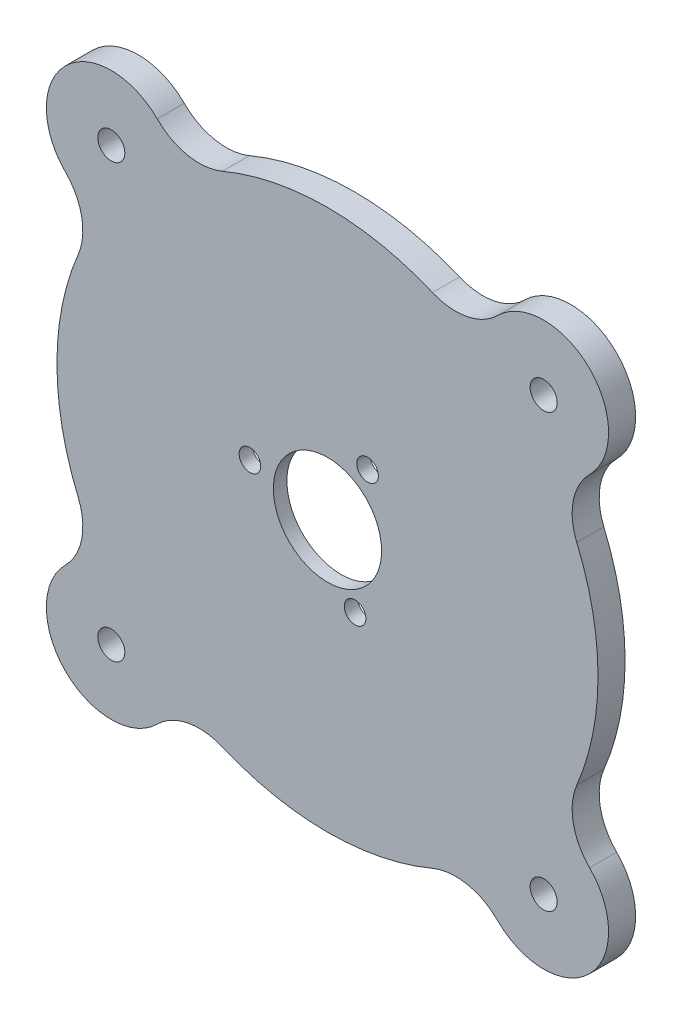
ISO-10303-21;
HEADER;
FILE_DESCRIPTION(('STEP AP214'),'2;1');
FILE_NAME('part.step','',(''),(''),'','','');
FILE_SCHEMA(('AUTOMOTIVE_DESIGN { 1 0 10303 214 1 1 1 1 }'));
ENDSEC;
DATA;
#1=APPLICATION_CONTEXT('core data for automotive mechanical design processes');
#2=APPLICATION_PROTOCOL_DEFINITION('international standard','automotive_design',2000,#1);
#3=PRODUCT_CONTEXT('',#1,'mechanical');
#4=PRODUCT('Part','Part','',(#3));
#5=PRODUCT_RELATED_PRODUCT_CATEGORY('part','',(#4));
#6=PRODUCT_DEFINITION_FORMATION('','',#4);
#7=PRODUCT_DEFINITION_CONTEXT('part definition',#1,'design');
#8=PRODUCT_DEFINITION('design','',#6,#7);
#9=PRODUCT_DEFINITION_SHAPE('','',#8);
#10=(LENGTH_UNIT() NAMED_UNIT(*) SI_UNIT(.MILLI.,.METRE.));
#11=(NAMED_UNIT(*) PLANE_ANGLE_UNIT() SI_UNIT($,.RADIAN.));
#12=(NAMED_UNIT(*) SI_UNIT($,.STERADIAN.) SOLID_ANGLE_UNIT());
#13=UNCERTAINTY_MEASURE_WITH_UNIT(LENGTH_MEASURE(1.E-05),#10,'distance_accuracy_value','');
#14=(GEOMETRIC_REPRESENTATION_CONTEXT(3) GLOBAL_UNCERTAINTY_ASSIGNED_CONTEXT((#13)) GLOBAL_UNIT_ASSIGNED_CONTEXT((#10,
#11,#12)) REPRESENTATION_CONTEXT('',''));
#15=CARTESIAN_POINT('',(0.,0.,0.));
#16=DIRECTION('',(0.,0.,1.));
#17=DIRECTION('',(1.,0.,0.));
#18=AXIS2_PLACEMENT_3D('',#15,#16,#17);
#19=CARTESIAN_POINT('',(-56.2173151134793,-23.6857511606009,10.));
#20=DIRECTION('',(0.,0.,1.));
#21=DIRECTION('',(1.,0.,0.));
#22=AXIS2_PLACEMENT_3D('',#19,#20,#21);
#23=PLANE('',#22);
#24=CARTESIAN_POINT('',(0.,0.,10.));
#25=DIRECTION('',(0.,0.,1.));
#26=DIRECTION('',(1.,0.,0.));
#27=AXIS2_PLACEMENT_3D('',#24,#25,#26);
#28=CIRCLE('',#27,20.);
#29=CARTESIAN_POINT('',(20.,0.,10.));
#30=VERTEX_POINT('',#29);
#31=EDGE_CURVE('E390',#30,#30,#28,.T.);
#32=ORIENTED_EDGE('',*,*,#31,.F.);
#33=EDGE_LOOP('',(#32));
#34=FACE_BOUND('',#33,.T.);
#35=CARTESIAN_POINT('',(-79.9030662740753,-79.9030677073512,10.));
#36=DIRECTION('',(0.,0.,1.));
#37=DIRECTION('',(1.,0.,0.));
#38=AXIS2_PLACEMENT_3D('',#35,#36,#37);
#39=CIRCLE('',#38,5.00000000000001);
#40=CARTESIAN_POINT('',(-74.9030662740753,-79.9030677073512,10.));
#41=VERTEX_POINT('',#40);
#42=EDGE_CURVE('E400',#41,#41,#39,.T.);
#43=ORIENTED_EDGE('',*,*,#42,.F.);
#44=EDGE_LOOP('',(#43));
#45=FACE_BOUND('',#44,.T.);
#46=CARTESIAN_POINT('',(79.9030662740794,79.9030662740804,10.));
#47=DIRECTION('',(0.,0.,1.));
#48=DIRECTION('',(1.,0.,0.));
#49=AXIS2_PLACEMENT_3D('',#46,#47,#48);
#50=CIRCLE('',#49,5.00000000000001);
#51=CARTESIAN_POINT('',(84.9030662740794,79.9030662740804,10.));
#52=VERTEX_POINT('',#51);
#53=EDGE_CURVE('E412',#52,#52,#50,.T.);
#54=ORIENTED_EDGE('',*,*,#53,.F.);
#55=EDGE_LOOP('',(#54));
#56=FACE_BOUND('',#55,.T.);
#57=CARTESIAN_POINT('',(10.2142663659799,-24.5395166705732,10.));
#58=DIRECTION('',(0.,0.,1.));
#59=DIRECTION('',(1.,0.,0.));
#60=AXIS2_PLACEMENT_3D('',#57,#58,#59);
#61=CIRCLE('',#60,4.);
#62=CARTESIAN_POINT('',(14.2142663659799,-24.5395166705732,10.));
#63=VERTEX_POINT('',#62);
#64=EDGE_CURVE('E420',#63,#63,#61,.T.);
#65=ORIENTED_EDGE('',*,*,#64,.F.);
#66=EDGE_LOOP('',(#65));
#67=FACE_BOUND('',#66,.T.);
#68=CARTESIAN_POINT('',(-112.434630226959,-47.371502321202,10.));
#69=DIRECTION('',(0.,0.,-1.));
#70=DIRECTION('',(1.,0.,0.));
#71=AXIS2_PLACEMENT_3D('',#68,#69,#70);
#72=CIRCLE('',#71,22.0065789473695);
#73=CARTESIAN_POINT('',(-92.154563464533,-38.8270064859674,10.));
#74=VERTEX_POINT('',#73);
#75=CARTESIAN_POINT('',(-96.8736290225562,-62.9325035256038,10.));
#76=VERTEX_POINT('',#75);
#77=EDGE_CURVE('E216',#74,#76,#72,.T.);
#78=ORIENTED_EDGE('',*,*,#77,.T.);
#79=CARTESIAN_POINT('',(-79.9030662740794,-79.9030662740803,10.));
#80=DIRECTION('',(0.,0.,1.));
#81=DIRECTION('',(1.,0.,0.));
#82=AXIS2_PLACEMENT_3D('',#79,#80,#81);
#83=CIRCLE('',#82,23.9999999999993);
#84=CARTESIAN_POINT('',(-62.932503525602,-96.8736290225561,10.));
#85=VERTEX_POINT('',#84);
#86=EDGE_CURVE('E124',#76,#85,#83,.T.);
#87=ORIENTED_EDGE('',*,*,#86,.T.);
#88=CARTESIAN_POINT('',(-47.3715023212008,-112.434630226959,10.));
#89=DIRECTION('',(0.,0.,-1.));
#90=DIRECTION('',(-1.,0.,0.));
#91=AXIS2_PLACEMENT_3D('',#88,#89,#90);
#92=CIRCLE('',#91,22.0065789473687);
#93=CARTESIAN_POINT('',(-38.8270064859666,-92.1545634645332,10.));
#94=VERTEX_POINT('',#93);
#95=EDGE_CURVE('E256',#85,#94,#92,.T.);
#96=ORIENTED_EDGE('',*,*,#95,.T.);
#97=CARTESIAN_POINT('',(0.,1.04083408558608E-13,10.));
#98=DIRECTION('',(0.,0.,1.));
#99=DIRECTION('',(1.,0.,0.));
#100=AXIS2_PLACEMENT_3D('',#97,#98,#99);
#101=CIRCLE('',#100,100.);
#102=CARTESIAN_POINT('',(38.8270064859666,-92.1545634645334,10.));
#103=VERTEX_POINT('',#102);
#104=EDGE_CURVE('E275',#94,#103,#101,.T.);
#105=ORIENTED_EDGE('',*,*,#104,.T.);
#106=CARTESIAN_POINT('',(47.3715023212008,-112.434630226959,10.));
#107=DIRECTION('',(0.,0.,-1.));
#108=DIRECTION('',(1.,0.,0.));
#109=AXIS2_PLACEMENT_3D('',#106,#107,#108);
#110=CIRCLE('',#109,22.0065789473694);
#111=CARTESIAN_POINT('',(62.9325035256023,-96.8736290225561,10.));
#112=VERTEX_POINT('',#111);
#113=EDGE_CURVE('E272',#103,#112,#110,.T.);
#114=ORIENTED_EDGE('',*,*,#113,.T.);
#115=CARTESIAN_POINT('',(79.9030662740795,-79.9030662740803,10.));
#116=DIRECTION('',(0.,0.,1.));
#117=DIRECTION('',(-1.,0.,0.));
#118=AXIS2_PLACEMENT_3D('',#115,#116,#117);
#119=CIRCLE('',#118,23.9999999999982);
#120=CARTESIAN_POINT('',(96.8736290225555,-62.9325035256045,10.));
#121=VERTEX_POINT('',#120);
#122=EDGE_CURVE('E274',#112,#121,#119,.T.);
#123=ORIENTED_EDGE('',*,*,#122,.T.);
#124=CARTESIAN_POINT('',(112.434630226959,-47.371502321202,10.));
#125=DIRECTION('',(0.,0.,-1.));
#126=DIRECTION('',(-1.,0.,0.));
#127=AXIS2_PLACEMENT_3D('',#124,#125,#126);
#128=CIRCLE('',#127,22.0065789473698);
#129=CARTESIAN_POINT('',(92.1545634645327,-38.827006485966,10.));
#130=VERTEX_POINT('',#129);
#131=EDGE_CURVE('E277',#121,#130,#128,.T.);
#132=ORIENTED_EDGE('',*,*,#131,.T.);
#133=CARTESIAN_POINT('',(0.,1.04083408558608E-13,10.));
#134=DIRECTION('',(0.,0.,1.));
#135=DIRECTION('',(1.,0.,0.));
#136=AXIS2_PLACEMENT_3D('',#133,#134,#135);
#137=CIRCLE('',#136,100.);
#138=CARTESIAN_POINT('',(92.154563464533,38.8270064859678,10.));
#139=VERTEX_POINT('',#138);
#140=EDGE_CURVE('E283',#130,#139,#137,.T.);
#141=ORIENTED_EDGE('',*,*,#140,.T.);
#142=CARTESIAN_POINT('',(112.434630226959,47.371502321202,10.));
#143=DIRECTION('',(0.,0.,-1.));
#144=DIRECTION('',(1.,0.,0.));
#145=AXIS2_PLACEMENT_3D('',#142,#143,#144);
#146=CIRCLE('',#145,22.0065789473689);
#147=CARTESIAN_POINT('',(96.8736290225568,62.9325035256034,10.));
#148=VERTEX_POINT('',#147);
#149=EDGE_CURVE('E285',#139,#148,#146,.T.);
#150=ORIENTED_EDGE('',*,*,#149,.T.);
#151=CARTESIAN_POINT('',(79.9030662740795,79.9030662740803,10.));
#152=DIRECTION('',(0.,0.,1.));
#153=DIRECTION('',(1.,0.,0.));
#154=AXIS2_PLACEMENT_3D('',#151,#152,#153);
#155=CIRCLE('',#154,24.);
#156=CARTESIAN_POINT('',(62.9325035256023,96.8736290225574,10.));
#157=VERTEX_POINT('',#156);
#158=EDGE_CURVE('E287',#148,#157,#155,.T.);
#159=ORIENTED_EDGE('',*,*,#158,.T.);
#160=CARTESIAN_POINT('',(47.3715023212009,112.434630226959,10.));
#161=DIRECTION('',(0.,0.,-1.));
#162=DIRECTION('',(-1.,0.,0.));
#163=AXIS2_PLACEMENT_3D('',#160,#161,#162);
#164=CIRCLE('',#163,22.0065789473684);
#165=CARTESIAN_POINT('',(38.8270064859668,92.1545634645333,10.));
#166=VERTEX_POINT('',#165);
#167=EDGE_CURVE('E289',#157,#166,#164,.T.);
#168=ORIENTED_EDGE('',*,*,#167,.T.);
#169=CARTESIAN_POINT('',(0.,1.04083408558608E-13,10.));
#170=DIRECTION('',(0.,0.,1.));
#171=DIRECTION('',(1.,0.,0.));
#172=AXIS2_PLACEMENT_3D('',#169,#170,#171);
#173=CIRCLE('',#172,99.9999999999999);
#174=CARTESIAN_POINT('',(-38.8270064859666,92.1545634645333,10.));
#175=VERTEX_POINT('',#174);
#176=EDGE_CURVE('E291',#166,#175,#173,.T.);
#177=ORIENTED_EDGE('',*,*,#176,.T.);
#178=CARTESIAN_POINT('',(-47.3715023212008,112.434630226959,10.));
#179=DIRECTION('',(0.,0.,-1.));
#180=DIRECTION('',(1.,0.,0.));
#181=AXIS2_PLACEMENT_3D('',#178,#179,#180);
#182=CIRCLE('',#181,22.0065789473688);
#183=CARTESIAN_POINT('',(-62.9325035256025,96.8736290225573,10.));
#184=VERTEX_POINT('',#183);
#185=EDGE_CURVE('E167',#175,#184,#182,.T.);
#186=ORIENTED_EDGE('',*,*,#185,.T.);
#187=CARTESIAN_POINT('',(-79.9030662740794,79.9030662740804,10.));
#188=DIRECTION('',(0.,0.,1.));
#189=DIRECTION('',(-1.,0.,0.));
#190=AXIS2_PLACEMENT_3D('',#187,#188,#189);
#191=CIRCLE('',#190,23.9999999999994);
#192=CARTESIAN_POINT('',(-96.8736290225569,62.9325035256045,10.));
#193=VERTEX_POINT('',#192);
#194=EDGE_CURVE('E161',#184,#193,#191,.T.);
#195=ORIENTED_EDGE('',*,*,#194,.T.);
#196=CARTESIAN_POINT('',(-112.434630226959,47.371502321202,10.));
#197=DIRECTION('',(0.,0.,-1.));
#198=DIRECTION('',(-1.,0.,0.));
#199=AXIS2_PLACEMENT_3D('',#196,#197,#198);
#200=CIRCLE('',#199,22.0065789473693);
#201=CARTESIAN_POINT('',(-92.1545634645327,38.8270064859674,10.));
#202=VERTEX_POINT('',#201);
#203=EDGE_CURVE('E165',#193,#202,#200,.T.);
#204=ORIENTED_EDGE('',*,*,#203,.T.);
#205=CARTESIAN_POINT('',(0.,1.04083408558608E-13,10.));
#206=DIRECTION('',(0.,0.,1.));
#207=DIRECTION('',(1.,0.,0.));
#208=AXIS2_PLACEMENT_3D('',#205,#206,#207);
#209=CIRCLE('',#208,100.);
#210=EDGE_CURVE('E57',#202,#74,#209,.T.);
#211=ORIENTED_EDGE('',*,*,#210,.T.);
#212=EDGE_LOOP('',(#78,#87,#96,#105,#114,#123,#132,#141,#150,#159,#168,#177,#186,#195,#204,#211));
#213=FACE_BOUND('',#212,.T.);
#214=CARTESIAN_POINT('',(-28.6595639109286,4.80192066370387,10.));
#215=DIRECTION('',(0.,0.,1.));
#216=DIRECTION('',(1.,0.,0.));
#217=AXIS2_PLACEMENT_3D('',#214,#215,#216);
#218=CIRCLE('',#217,4.00000000000001);
#219=CARTESIAN_POINT('',(-24.6595639109286,4.80192066370387,10.));
#220=VERTEX_POINT('',#219);
#221=EDGE_CURVE('E189',#220,#220,#218,.T.);
#222=ORIENTED_EDGE('',*,*,#221,.F.);
#223=EDGE_LOOP('',(#222));
#224=FACE_BOUND('',#223,.T.);
#225=CARTESIAN_POINT('',(14.8230014157488,23.4644914122328,10.));
#226=DIRECTION('',(0.,0.,1.));
#227=DIRECTION('',(1.,0.,0.));
#228=AXIS2_PLACEMENT_3D('',#225,#226,#227);
#229=CIRCLE('',#228,4.);
#230=CARTESIAN_POINT('',(18.8230014157488,23.4644914122328,10.));
#231=VERTEX_POINT('',#230);
#232=EDGE_CURVE('E415',#231,#231,#229,.T.);
#233=ORIENTED_EDGE('',*,*,#232,.F.);
#234=EDGE_LOOP('',(#233));
#235=FACE_BOUND('',#234,.T.);
#236=CARTESIAN_POINT('',(79.9030669907178,-79.9030669907129,10.));
#237=DIRECTION('',(0.,0.,1.));
#238=DIRECTION('',(1.,0.,0.));
#239=AXIS2_PLACEMENT_3D('',#236,#237,#238);
#240=CIRCLE('',#239,5.00000000000001);
#241=CARTESIAN_POINT('',(84.9030669907178,-79.9030669907129,10.));
#242=VERTEX_POINT('',#241);
#243=EDGE_CURVE('E406',#242,#242,#240,.T.);
#244=ORIENTED_EDGE('',*,*,#243,.F.);
#245=EDGE_LOOP('',(#244));
#246=FACE_BOUND('',#245,.T.);
#247=CARTESIAN_POINT('',(-79.9030669907137,79.9030655574419,10.));
#248=DIRECTION('',(0.,0.,1.));
#249=DIRECTION('',(1.,0.,0.));
#250=AXIS2_PLACEMENT_3D('',#247,#248,#249);
#251=CIRCLE('',#250,5.00000000000001);
#252=CARTESIAN_POINT('',(-74.9030669907137,79.9030655574419,10.));
#253=VERTEX_POINT('',#252);
#254=EDGE_CURVE('E394',#253,#253,#251,.T.);
#255=ORIENTED_EDGE('',*,*,#254,.F.);
#256=EDGE_LOOP('',(#255));
#257=FACE_BOUND('',#256,.T.);
#258=ADVANCED_FACE('F39',(#34,#45,#56,#67,#213,#224,#235,#246,#257),#23,.T.);
#259=CARTESIAN_POINT('',(-56.2173151134793,-23.6857511606009,0.));
#260=DIRECTION('',(0.,0.,1.));
#261=DIRECTION('',(1.,0.,0.));
#262=AXIS2_PLACEMENT_3D('',#259,#260,#261);
#263=PLANE('',#262);
#264=CARTESIAN_POINT('',(-0.919801825911643,0.750296011578611,0.));
#265=DIRECTION('',(0.,0.,1.));
#266=DIRECTION('',(1.,0.,0.));
#267=AXIS2_PLACEMENT_3D('',#264,#265,#266);
#268=CIRCLE('',#267,42.5);
#269=CARTESIAN_POINT('',(41.5801981740884,0.750296011578611,0.));
#270=VERTEX_POINT('',#269);
#271=EDGE_CURVE('E382',#270,#270,#268,.T.);
#272=ORIENTED_EDGE('',*,*,#271,.T.);
#273=EDGE_LOOP('',(#272));
#274=FACE_BOUND('',#273,.T.);
#275=CARTESIAN_POINT('',(-112.434630226959,-47.371502321202,0.));
#276=DIRECTION('',(0.,0.,-1.));
#277=DIRECTION('',(1.,0.,0.));
#278=AXIS2_PLACEMENT_3D('',#275,#276,#277);
#279=CIRCLE('',#278,22.0065789473695);
#280=CARTESIAN_POINT('',(-92.154563464533,-38.8270064859674,0.));
#281=VERTEX_POINT('',#280);
#282=CARTESIAN_POINT('',(-96.8736290225562,-62.9325035256038,0.));
#283=VERTEX_POINT('',#282);
#284=EDGE_CURVE('E185',#281,#283,#279,.T.);
#285=ORIENTED_EDGE('',*,*,#284,.F.);
#286=CARTESIAN_POINT('',(0.,1.04083408558608E-13,0.));
#287=DIRECTION('',(0.,0.,1.));
#288=DIRECTION('',(1.,0.,0.));
#289=AXIS2_PLACEMENT_3D('',#286,#287,#288);
#290=CIRCLE('',#289,100.);
#291=CARTESIAN_POINT('',(-92.1545634645327,38.8270064859674,0.));
#292=VERTEX_POINT('',#291);
#293=EDGE_CURVE('E116',#292,#281,#290,.T.);
#294=ORIENTED_EDGE('',*,*,#293,.F.);
#295=CARTESIAN_POINT('',(-112.434630226959,47.371502321202,0.));
#296=DIRECTION('',(0.,0.,-1.));
#297=DIRECTION('',(-1.,0.,0.));
#298=AXIS2_PLACEMENT_3D('',#295,#296,#297);
#299=CIRCLE('',#298,22.0065789473693);
#300=CARTESIAN_POINT('',(-96.8736290225569,62.9325035256045,0.));
#301=VERTEX_POINT('',#300);
#302=EDGE_CURVE('E110',#301,#292,#299,.T.);
#303=ORIENTED_EDGE('',*,*,#302,.F.);
#304=CARTESIAN_POINT('',(-79.9030662740794,79.9030662740804,0.));
#305=DIRECTION('',(0.,0.,1.));
#306=DIRECTION('',(-1.,0.,0.));
#307=AXIS2_PLACEMENT_3D('',#304,#305,#306);
#308=CIRCLE('',#307,23.9999999999994);
#309=CARTESIAN_POINT('',(-62.9325035256025,96.8736290225573,0.));
#310=VERTEX_POINT('',#309);
#311=EDGE_CURVE('E175',#310,#301,#308,.T.);
#312=ORIENTED_EDGE('',*,*,#311,.F.);
#313=CARTESIAN_POINT('',(-47.3715023212008,112.434630226959,0.));
#314=DIRECTION('',(0.,0.,-1.));
#315=DIRECTION('',(1.,0.,0.));
#316=AXIS2_PLACEMENT_3D('',#313,#314,#315);
#317=CIRCLE('',#316,22.0065789473688);
#318=CARTESIAN_POINT('',(-38.8270064859666,92.1545634645333,0.));
#319=VERTEX_POINT('',#318);
#320=EDGE_CURVE('E211',#319,#310,#317,.T.);
#321=ORIENTED_EDGE('',*,*,#320,.F.);
#322=CARTESIAN_POINT('',(0.,1.04083408558608E-13,0.));
#323=DIRECTION('',(0.,0.,1.));
#324=DIRECTION('',(1.,0.,0.));
#325=AXIS2_PLACEMENT_3D('',#322,#323,#324);
#326=CIRCLE('',#325,99.9999999999999);
#327=CARTESIAN_POINT('',(38.8270064859668,92.1545634645333,0.));
#328=VERTEX_POINT('',#327);
#329=EDGE_CURVE('E209',#328,#319,#326,.T.);
#330=ORIENTED_EDGE('',*,*,#329,.F.);
#331=CARTESIAN_POINT('',(47.3715023212009,112.434630226959,0.));
#332=DIRECTION('',(0.,0.,-1.));
#333=DIRECTION('',(-1.,0.,0.));
#334=AXIS2_PLACEMENT_3D('',#331,#332,#333);
#335=CIRCLE('',#334,22.0065789473684);
#336=CARTESIAN_POINT('',(62.9325035256023,96.8736290225574,0.));
#337=VERTEX_POINT('',#336);
#338=EDGE_CURVE('E207',#337,#328,#335,.T.);
#339=ORIENTED_EDGE('',*,*,#338,.F.);
#340=CARTESIAN_POINT('',(79.9030662740795,79.9030662740803,0.));
#341=DIRECTION('',(0.,0.,1.));
#342=DIRECTION('',(1.,0.,0.));
#343=AXIS2_PLACEMENT_3D('',#340,#341,#342);
#344=CIRCLE('',#343,24.);
#345=CARTESIAN_POINT('',(96.8736290225568,62.9325035256034,0.));
#346=VERTEX_POINT('',#345);
#347=EDGE_CURVE('E205',#346,#337,#344,.T.);
#348=ORIENTED_EDGE('',*,*,#347,.F.);
#349=CARTESIAN_POINT('',(112.434630226959,47.371502321202,0.));
#350=DIRECTION('',(0.,0.,-1.));
#351=DIRECTION('',(1.,0.,0.));
#352=AXIS2_PLACEMENT_3D('',#349,#350,#351);
#353=CIRCLE('',#352,22.0065789473689);
#354=CARTESIAN_POINT('',(92.154563464533,38.8270064859678,0.));
#355=VERTEX_POINT('',#354);
#356=EDGE_CURVE('E203',#355,#346,#353,.T.);
#357=ORIENTED_EDGE('',*,*,#356,.F.);
#358=CARTESIAN_POINT('',(0.,1.04083408558608E-13,0.));
#359=DIRECTION('',(0.,0.,1.));
#360=DIRECTION('',(1.,0.,0.));
#361=AXIS2_PLACEMENT_3D('',#358,#359,#360);
#362=CIRCLE('',#361,100.);
#363=CARTESIAN_POINT('',(92.1545634645327,-38.827006485966,0.));
#364=VERTEX_POINT('',#363);
#365=EDGE_CURVE('E201',#364,#355,#362,.T.);
#366=ORIENTED_EDGE('',*,*,#365,.F.);
#367=CARTESIAN_POINT('',(112.434630226959,-47.371502321202,0.));
#368=DIRECTION('',(0.,0.,-1.));
#369=DIRECTION('',(-1.,0.,0.));
#370=AXIS2_PLACEMENT_3D('',#367,#368,#369);
#371=CIRCLE('',#370,22.0065789473698);
#372=CARTESIAN_POINT('',(96.8736290225555,-62.9325035256045,0.));
#373=VERTEX_POINT('',#372);
#374=EDGE_CURVE('E199',#373,#364,#371,.T.);
#375=ORIENTED_EDGE('',*,*,#374,.F.);
#376=CARTESIAN_POINT('',(79.9030662740795,-79.9030662740803,0.));
#377=DIRECTION('',(0.,0.,1.));
#378=DIRECTION('',(-1.,0.,0.));
#379=AXIS2_PLACEMENT_3D('',#376,#377,#378);
#380=CIRCLE('',#379,23.9999999999982);
#381=CARTESIAN_POINT('',(62.9325035256023,-96.8736290225561,0.));
#382=VERTEX_POINT('',#381);
#383=EDGE_CURVE('E197',#382,#373,#380,.T.);
#384=ORIENTED_EDGE('',*,*,#383,.F.);
#385=CARTESIAN_POINT('',(47.3715023212008,-112.434630226959,0.));
#386=DIRECTION('',(0.,0.,-1.));
#387=DIRECTION('',(1.,0.,0.));
#388=AXIS2_PLACEMENT_3D('',#385,#386,#387);
#389=CIRCLE('',#388,22.0065789473694);
#390=CARTESIAN_POINT('',(38.8270064859666,-92.1545634645334,0.));
#391=VERTEX_POINT('',#390);
#392=EDGE_CURVE('E195',#391,#382,#389,.T.);
#393=ORIENTED_EDGE('',*,*,#392,.F.);
#394=CARTESIAN_POINT('',(0.,1.04083408558608E-13,0.));
#395=DIRECTION('',(0.,0.,1.));
#396=DIRECTION('',(1.,0.,0.));
#397=AXIS2_PLACEMENT_3D('',#394,#395,#396);
#398=CIRCLE('',#397,100.);
#399=CARTESIAN_POINT('',(-38.8270064859666,-92.1545634645332,0.));
#400=VERTEX_POINT('',#399);
#401=EDGE_CURVE('E193',#400,#391,#398,.T.);
#402=ORIENTED_EDGE('',*,*,#401,.F.);
#403=CARTESIAN_POINT('',(-47.3715023212008,-112.434630226959,0.));
#404=DIRECTION('',(0.,0.,-1.));
#405=DIRECTION('',(-1.,0.,0.));
#406=AXIS2_PLACEMENT_3D('',#403,#404,#405);
#407=CIRCLE('',#406,22.0065789473687);
#408=CARTESIAN_POINT('',(-62.932503525602,-96.8736290225561,0.));
#409=VERTEX_POINT('',#408);
#410=EDGE_CURVE('E191',#409,#400,#407,.T.);
#411=ORIENTED_EDGE('',*,*,#410,.F.);
#412=CARTESIAN_POINT('',(-79.9030662740794,-79.9030662740803,0.));
#413=DIRECTION('',(0.,0.,1.));
#414=DIRECTION('',(1.,0.,0.));
#415=AXIS2_PLACEMENT_3D('',#412,#413,#414);
#416=CIRCLE('',#415,23.9999999999993);
#417=EDGE_CURVE('E188',#283,#409,#416,.T.);
#418=ORIENTED_EDGE('',*,*,#417,.F.);
#419=EDGE_LOOP('',(#285,#294,#303,#312,#321,#330,#339,#348,#357,#366,#375,#384,#393,#402,#411,#418));
#420=FACE_BOUND('',#419,.T.);
#421=CARTESIAN_POINT('',(79.9030662740794,79.9030662740804,0.));
#422=DIRECTION('',(0.,0.,1.));
#423=DIRECTION('',(1.,0.,0.));
#424=AXIS2_PLACEMENT_3D('',#421,#422,#423);
#425=CIRCLE('',#424,5.00000000000001);
#426=CARTESIAN_POINT('',(84.9030662740794,79.9030662740804,0.));
#427=VERTEX_POINT('',#426);
#428=EDGE_CURVE('E409',#427,#427,#425,.T.);
#429=ORIENTED_EDGE('',*,*,#428,.T.);
#430=EDGE_LOOP('',(#429));
#431=FACE_BOUND('',#430,.T.);
#432=CARTESIAN_POINT('',(79.9030669907178,-79.9030669907129,0.));
#433=DIRECTION('',(0.,0.,1.));
#434=DIRECTION('',(1.,0.,0.));
#435=AXIS2_PLACEMENT_3D('',#432,#433,#434);
#436=CIRCLE('',#435,5.00000000000001);
#437=CARTESIAN_POINT('',(84.9030669907178,-79.9030669907129,0.));
#438=VERTEX_POINT('',#437);
#439=EDGE_CURVE('E403',#438,#438,#436,.T.);
#440=ORIENTED_EDGE('',*,*,#439,.T.);
#441=EDGE_LOOP('',(#440));
#442=FACE_BOUND('',#441,.T.);
#443=CARTESIAN_POINT('',(-79.9030662740753,-79.9030677073512,0.));
#444=DIRECTION('',(0.,0.,1.));
#445=DIRECTION('',(1.,0.,0.));
#446=AXIS2_PLACEMENT_3D('',#443,#444,#445);
#447=CIRCLE('',#446,5.00000000000001);
#448=CARTESIAN_POINT('',(-74.9030662740753,-79.9030677073512,0.));
#449=VERTEX_POINT('',#448);
#450=EDGE_CURVE('E397',#449,#449,#447,.T.);
#451=ORIENTED_EDGE('',*,*,#450,.T.);
#452=EDGE_LOOP('',(#451));
#453=FACE_BOUND('',#452,.T.);
#454=CARTESIAN_POINT('',(-79.9030669907137,79.9030655574419,0.));
#455=DIRECTION('',(0.,0.,1.));
#456=DIRECTION('',(1.,0.,0.));
#457=AXIS2_PLACEMENT_3D('',#454,#455,#456);
#458=CIRCLE('',#457,5.00000000000001);
#459=CARTESIAN_POINT('',(-74.9030669907137,79.9030655574419,0.));
#460=VERTEX_POINT('',#459);
#461=EDGE_CURVE('E393',#460,#460,#458,.T.);
#462=ORIENTED_EDGE('',*,*,#461,.T.);
#463=EDGE_LOOP('',(#462));
#464=FACE_BOUND('',#463,.T.);
#465=ADVANCED_FACE('F260',(#274,#420,#431,#442,#453,#464),#263,.F.);
#466=CARTESIAN_POINT('',(-112.434630226959,-47.371502321202,10.));
#467=DIRECTION('',(0.,0.,-1.));
#468=DIRECTION('',(-1.,0.,0.));
#469=AXIS2_PLACEMENT_3D('',#466,#467,#468);
#470=CYLINDRICAL_SURFACE('',#469,22.0065789473695);
#471=ORIENTED_EDGE('',*,*,#284,.T.);
#472=DIRECTION('',(0.,0.,-1.));
#473=VECTOR('',#472,1.);
#474=CARTESIAN_POINT('',(-96.8736290225562,-62.9325035256038,10.));
#475=LINE('',#474,#473);
#476=EDGE_CURVE('E11',#76,#283,#475,.T.);
#477=ORIENTED_EDGE('',*,*,#476,.F.);
#478=ORIENTED_EDGE('',*,*,#77,.F.);
#479=DIRECTION('',(0.,0.,-1.));
#480=VECTOR('',#479,1.);
#481=CARTESIAN_POINT('',(-92.154563464533,-38.8270064859674,10.));
#482=LINE('',#481,#480);
#483=EDGE_CURVE('E181',#74,#281,#482,.T.);
#484=ORIENTED_EDGE('',*,*,#483,.T.);
#485=EDGE_LOOP('',(#471,#477,#478,#484));
#486=FACE_BOUND('',#485,.T.);
#487=ADVANCED_FACE('F41',(#486),#470,.F.);
#488=CARTESIAN_POINT('',(-79.9030662740794,-79.9030662740803,10.));
#489=DIRECTION('',(0.,0.,-1.));
#490=DIRECTION('',(-1.,0.,0.));
#491=AXIS2_PLACEMENT_3D('',#488,#489,#490);
#492=CYLINDRICAL_SURFACE('',#491,23.9999999999993);
#493=ORIENTED_EDGE('',*,*,#417,.T.);
#494=DIRECTION('',(0.,0.,-1.));
#495=VECTOR('',#494,1.);
#496=CARTESIAN_POINT('',(-62.932503525602,-96.8736290225561,10.));
#497=LINE('',#496,#495);
#498=EDGE_CURVE('E49',#85,#409,#497,.T.);
#499=ORIENTED_EDGE('',*,*,#498,.F.);
#500=ORIENTED_EDGE('',*,*,#86,.F.);
#501=ORIENTED_EDGE('',*,*,#476,.T.);
#502=EDGE_LOOP('',(#493,#499,#500,#501));
#503=FACE_BOUND('',#502,.T.);
#504=ADVANCED_FACE('F587',(#503),#492,.T.);
#505=CARTESIAN_POINT('',(-47.3715023212008,-112.434630226959,10.));
#506=DIRECTION('',(0.,0.,-1.));
#507=DIRECTION('',(-1.,0.,0.));
#508=AXIS2_PLACEMENT_3D('',#505,#506,#507);
#509=CYLINDRICAL_SURFACE('',#508,22.0065789473687);
#510=ORIENTED_EDGE('',*,*,#410,.T.);
#511=DIRECTION('',(0.,0.,-1.));
#512=VECTOR('',#511,1.);
#513=CARTESIAN_POINT('',(-38.8270064859666,-92.1545634645332,10.));
#514=LINE('',#513,#512);
#515=EDGE_CURVE('E247',#94,#400,#514,.T.);
#516=ORIENTED_EDGE('',*,*,#515,.F.);
#517=ORIENTED_EDGE('',*,*,#95,.F.);
#518=ORIENTED_EDGE('',*,*,#498,.T.);
#519=EDGE_LOOP('',(#510,#516,#517,#518));
#520=FACE_BOUND('',#519,.T.);
#521=ADVANCED_FACE('F254',(#520),#509,.F.);
#522=CARTESIAN_POINT('',(0.,1.04083408558608E-13,10.));
#523=DIRECTION('',(0.,0.,-1.));
#524=DIRECTION('',(-1.,0.,0.));
#525=AXIS2_PLACEMENT_3D('',#522,#523,#524);
#526=CYLINDRICAL_SURFACE('',#525,100.);
#527=ORIENTED_EDGE('',*,*,#401,.T.);
#528=DIRECTION('',(0.,0.,-1.));
#529=VECTOR('',#528,1.);
#530=CARTESIAN_POINT('',(38.8270064859666,-92.1545634645334,10.));
#531=LINE('',#530,#529);
#532=EDGE_CURVE('E244',#103,#391,#531,.T.);
#533=ORIENTED_EDGE('',*,*,#532,.F.);
#534=ORIENTED_EDGE('',*,*,#104,.F.);
#535=ORIENTED_EDGE('',*,*,#515,.T.);
#536=EDGE_LOOP('',(#527,#533,#534,#535));
#537=FACE_BOUND('',#536,.T.);
#538=ADVANCED_FACE('F266',(#537),#526,.T.);
#539=CARTESIAN_POINT('',(47.3715023212008,-112.434630226959,10.));
#540=DIRECTION('',(0.,0.,-1.));
#541=DIRECTION('',(-1.,0.,0.));
#542=AXIS2_PLACEMENT_3D('',#539,#540,#541);
#543=CYLINDRICAL_SURFACE('',#542,22.0065789473694);
#544=ORIENTED_EDGE('',*,*,#392,.T.);
#545=DIRECTION('',(0.,0.,-1.));
#546=VECTOR('',#545,1.);
#547=CARTESIAN_POINT('',(62.9325035256023,-96.8736290225561,10.));
#548=LINE('',#547,#546);
#549=EDGE_CURVE('E241',#112,#382,#548,.T.);
#550=ORIENTED_EDGE('',*,*,#549,.F.);
#551=ORIENTED_EDGE('',*,*,#113,.F.);
#552=ORIENTED_EDGE('',*,*,#532,.T.);
#553=EDGE_LOOP('',(#544,#550,#551,#552));
#554=FACE_BOUND('',#553,.T.);
#555=ADVANCED_FACE('F270',(#554),#543,.F.);
#556=CARTESIAN_POINT('',(79.9030662740795,-79.9030662740803,10.));
#557=DIRECTION('',(0.,0.,-1.));
#558=DIRECTION('',(-1.,0.,0.));
#559=AXIS2_PLACEMENT_3D('',#556,#557,#558);
#560=CYLINDRICAL_SURFACE('',#559,23.9999999999982);
#561=ORIENTED_EDGE('',*,*,#383,.T.);
#562=DIRECTION('',(0.,0.,-1.));
#563=VECTOR('',#562,1.);
#564=CARTESIAN_POINT('',(96.8736290225555,-62.9325035256045,10.));
#565=LINE('',#564,#563);
#566=EDGE_CURVE('E238',#121,#373,#565,.T.);
#567=ORIENTED_EDGE('',*,*,#566,.F.);
#568=ORIENTED_EDGE('',*,*,#122,.F.);
#569=ORIENTED_EDGE('',*,*,#549,.T.);
#570=EDGE_LOOP('',(#561,#567,#568,#569));
#571=FACE_BOUND('',#570,.T.);
#572=ADVANCED_FACE('F556',(#571),#560,.T.);
#573=CARTESIAN_POINT('',(112.434630226959,-47.371502321202,10.));
#574=DIRECTION('',(0.,0.,-1.));
#575=DIRECTION('',(-1.,0.,0.));
#576=AXIS2_PLACEMENT_3D('',#573,#574,#575);
#577=CYLINDRICAL_SURFACE('',#576,22.0065789473698);
#578=ORIENTED_EDGE('',*,*,#374,.T.);
#579=DIRECTION('',(0.,0.,-1.));
#580=VECTOR('',#579,1.);
#581=CARTESIAN_POINT('',(92.1545634645327,-38.827006485966,10.));
#582=LINE('',#581,#580);
#583=EDGE_CURVE('E235',#130,#364,#582,.T.);
#584=ORIENTED_EDGE('',*,*,#583,.F.);
#585=ORIENTED_EDGE('',*,*,#131,.F.);
#586=ORIENTED_EDGE('',*,*,#566,.T.);
#587=EDGE_LOOP('',(#578,#584,#585,#586));
#588=FACE_BOUND('',#587,.T.);
#589=ADVANCED_FACE('F547',(#588),#577,.F.);
#590=CARTESIAN_POINT('',(0.,1.04083408558608E-13,10.));
#591=DIRECTION('',(0.,0.,-1.));
#592=DIRECTION('',(-1.,0.,0.));
#593=AXIS2_PLACEMENT_3D('',#590,#591,#592);
#594=CYLINDRICAL_SURFACE('',#593,100.);
#595=ORIENTED_EDGE('',*,*,#365,.T.);
#596=DIRECTION('',(0.,0.,-1.));
#597=VECTOR('',#596,1.);
#598=CARTESIAN_POINT('',(92.154563464533,38.8270064859678,10.));
#599=LINE('',#598,#597);
#600=EDGE_CURVE('E232',#139,#355,#599,.T.);
#601=ORIENTED_EDGE('',*,*,#600,.F.);
#602=ORIENTED_EDGE('',*,*,#140,.F.);
#603=ORIENTED_EDGE('',*,*,#583,.T.);
#604=EDGE_LOOP('',(#595,#601,#602,#603));
#605=FACE_BOUND('',#604,.T.);
#606=ADVANCED_FACE('F538',(#605),#594,.T.);
#607=CARTESIAN_POINT('',(112.434630226959,47.371502321202,10.));
#608=DIRECTION('',(0.,0.,-1.));
#609=DIRECTION('',(-1.,0.,0.));
#610=AXIS2_PLACEMENT_3D('',#607,#608,#609);
#611=CYLINDRICAL_SURFACE('',#610,22.0065789473689);
#612=ORIENTED_EDGE('',*,*,#356,.T.);
#613=DIRECTION('',(0.,0.,-1.));
#614=VECTOR('',#613,1.);
#615=CARTESIAN_POINT('',(96.8736290225568,62.9325035256034,10.));
#616=LINE('',#615,#614);
#617=EDGE_CURVE('E229',#148,#346,#616,.T.);
#618=ORIENTED_EDGE('',*,*,#617,.F.);
#619=ORIENTED_EDGE('',*,*,#149,.F.);
#620=ORIENTED_EDGE('',*,*,#600,.T.);
#621=EDGE_LOOP('',(#612,#618,#619,#620));
#622=FACE_BOUND('',#621,.T.);
#623=ADVANCED_FACE('F529',(#622),#611,.F.);
#624=CARTESIAN_POINT('',(79.9030662740795,79.9030662740803,10.));
#625=DIRECTION('',(0.,0.,-1.));
#626=DIRECTION('',(-1.,0.,0.));
#627=AXIS2_PLACEMENT_3D('',#624,#625,#626);
#628=CYLINDRICAL_SURFACE('',#627,24.);
#629=ORIENTED_EDGE('',*,*,#347,.T.);
#630=DIRECTION('',(0.,0.,-1.));
#631=VECTOR('',#630,1.);
#632=CARTESIAN_POINT('',(62.9325035256023,96.8736290225574,10.));
#633=LINE('',#632,#631);
#634=EDGE_CURVE('E226',#157,#337,#633,.T.);
#635=ORIENTED_EDGE('',*,*,#634,.F.);
#636=ORIENTED_EDGE('',*,*,#158,.F.);
#637=ORIENTED_EDGE('',*,*,#617,.T.);
#638=EDGE_LOOP('',(#629,#635,#636,#637));
#639=FACE_BOUND('',#638,.T.);
#640=ADVANCED_FACE('F520',(#639),#628,.T.);
#641=CARTESIAN_POINT('',(47.3715023212009,112.434630226959,10.));
#642=DIRECTION('',(0.,0.,-1.));
#643=DIRECTION('',(-1.,0.,0.));
#644=AXIS2_PLACEMENT_3D('',#641,#642,#643);
#645=CYLINDRICAL_SURFACE('',#644,22.0065789473684);
#646=ORIENTED_EDGE('',*,*,#338,.T.);
#647=DIRECTION('',(0.,0.,-1.));
#648=VECTOR('',#647,1.);
#649=CARTESIAN_POINT('',(38.8270064859668,92.1545634645333,10.));
#650=LINE('',#649,#648);
#651=EDGE_CURVE('E223',#166,#328,#650,.T.);
#652=ORIENTED_EDGE('',*,*,#651,.F.);
#653=ORIENTED_EDGE('',*,*,#167,.F.);
#654=ORIENTED_EDGE('',*,*,#634,.T.);
#655=EDGE_LOOP('',(#646,#652,#653,#654));
#656=FACE_BOUND('',#655,.T.);
#657=ADVANCED_FACE('F512',(#656),#645,.F.);
#658=CARTESIAN_POINT('',(0.,1.04083408558608E-13,10.));
#659=DIRECTION('',(0.,0.,-1.));
#660=DIRECTION('',(-1.,0.,0.));
#661=AXIS2_PLACEMENT_3D('',#658,#659,#660);
#662=CYLINDRICAL_SURFACE('',#661,99.9999999999999);
#663=ORIENTED_EDGE('',*,*,#329,.T.);
#664=DIRECTION('',(0.,0.,-1.));
#665=VECTOR('',#664,1.);
#666=CARTESIAN_POINT('',(-38.8270064859666,92.1545634645333,10.));
#667=LINE('',#666,#665);
#668=EDGE_CURVE('E220',#175,#319,#667,.T.);
#669=ORIENTED_EDGE('',*,*,#668,.F.);
#670=ORIENTED_EDGE('',*,*,#176,.F.);
#671=ORIENTED_EDGE('',*,*,#651,.T.);
#672=EDGE_LOOP('',(#663,#669,#670,#671));
#673=FACE_BOUND('',#672,.T.);
#674=ADVANCED_FACE('F297',(#673),#662,.T.);
#675=CARTESIAN_POINT('',(-47.3715023212008,112.434630226959,10.));
#676=DIRECTION('',(0.,0.,-1.));
#677=DIRECTION('',(-1.,0.,0.));
#678=AXIS2_PLACEMENT_3D('',#675,#676,#677);
#679=CYLINDRICAL_SURFACE('',#678,22.0065789473688);
#680=ORIENTED_EDGE('',*,*,#320,.T.);
#681=DIRECTION('',(0.,0.,-1.));
#682=VECTOR('',#681,1.);
#683=CARTESIAN_POINT('',(-62.9325035256025,96.8736290225573,10.));
#684=LINE('',#683,#682);
#685=EDGE_CURVE('E176',#184,#310,#684,.T.);
#686=ORIENTED_EDGE('',*,*,#685,.F.);
#687=ORIENTED_EDGE('',*,*,#185,.F.);
#688=ORIENTED_EDGE('',*,*,#668,.T.);
#689=EDGE_LOOP('',(#680,#686,#687,#688));
#690=FACE_BOUND('',#689,.T.);
#691=ADVANCED_FACE('F301',(#690),#679,.F.);
#692=CARTESIAN_POINT('',(-79.9030662740794,79.9030662740804,10.));
#693=DIRECTION('',(0.,0.,-1.));
#694=DIRECTION('',(-1.,0.,0.));
#695=AXIS2_PLACEMENT_3D('',#692,#693,#694);
#696=CYLINDRICAL_SURFACE('',#695,23.9999999999994);
#697=ORIENTED_EDGE('',*,*,#311,.T.);
#698=DIRECTION('',(0.,0.,-1.));
#699=VECTOR('',#698,1.);
#700=CARTESIAN_POINT('',(-96.8736290225569,62.9325035256045,10.));
#701=LINE('',#700,#699);
#702=EDGE_CURVE('E172',#193,#301,#701,.T.);
#703=ORIENTED_EDGE('',*,*,#702,.F.);
#704=ORIENTED_EDGE('',*,*,#194,.F.);
#705=ORIENTED_EDGE('',*,*,#685,.T.);
#706=EDGE_LOOP('',(#697,#703,#704,#705));
#707=FACE_BOUND('',#706,.T.);
#708=ADVANCED_FACE('F173',(#707),#696,.T.);
#709=CARTESIAN_POINT('',(-112.434630226959,47.371502321202,10.));
#710=DIRECTION('',(0.,0.,-1.));
#711=DIRECTION('',(-1.,0.,0.));
#712=AXIS2_PLACEMENT_3D('',#709,#710,#711);
#713=CYLINDRICAL_SURFACE('',#712,22.0065789473693);
#714=ORIENTED_EDGE('',*,*,#302,.T.);
#715=DIRECTION('',(0.,0.,-1.));
#716=VECTOR('',#715,1.);
#717=CARTESIAN_POINT('',(-92.1545634645327,38.8270064859674,10.));
#718=LINE('',#717,#716);
#719=EDGE_CURVE('E177',#202,#292,#718,.T.);
#720=ORIENTED_EDGE('',*,*,#719,.F.);
#721=ORIENTED_EDGE('',*,*,#203,.F.);
#722=ORIENTED_EDGE('',*,*,#702,.T.);
#723=EDGE_LOOP('',(#714,#720,#721,#722));
#724=FACE_BOUND('',#723,.T.);
#725=ADVANCED_FACE('F179',(#724),#713,.F.);
#726=CARTESIAN_POINT('',(0.,1.04083408558608E-13,10.));
#727=DIRECTION('',(0.,0.,-1.));
#728=DIRECTION('',(-1.,0.,0.));
#729=AXIS2_PLACEMENT_3D('',#726,#727,#728);
#730=CYLINDRICAL_SURFACE('',#729,100.);
#731=ORIENTED_EDGE('',*,*,#293,.T.);
#732=ORIENTED_EDGE('',*,*,#483,.F.);
#733=ORIENTED_EDGE('',*,*,#210,.F.);
#734=ORIENTED_EDGE('',*,*,#719,.T.);
#735=EDGE_LOOP('',(#731,#732,#733,#734));
#736=FACE_BOUND('',#735,.T.);
#737=ADVANCED_FACE('F305',(#736),#730,.T.);
#738=CARTESIAN_POINT('',(-28.6595639109286,4.80192066370387,10.));
#739=DIRECTION('',(0.,0.,-1.));
#740=DIRECTION('',(-1.,0.,0.));
#741=AXIS2_PLACEMENT_3D('',#738,#739,#740);
#742=CYLINDRICAL_SURFACE('',#741,4.00000000000001);
#743=CARTESIAN_POINT('',(-28.6595639109286,4.80192066370387,5.));
#744=DIRECTION('',(0.,0.,1.));
#745=DIRECTION('',(1.,0.,0.));
#746=AXIS2_PLACEMENT_3D('',#743,#744,#745);
#747=CIRCLE('',#746,4.00000000000001);
#748=CARTESIAN_POINT('',(-24.6595639109286,4.80192066370387,5.));
#749=VERTEX_POINT('',#748);
#750=EDGE_CURVE('E367',#749,#749,#747,.T.);
#751=ORIENTED_EDGE('',*,*,#750,.F.);
#752=EDGE_LOOP('',(#751));
#753=FACE_BOUND('',#752,.T.);
#754=ORIENTED_EDGE('',*,*,#221,.T.);
#755=EDGE_LOOP('',(#754));
#756=FACE_BOUND('',#755,.T.);
#757=ADVANCED_FACE('F307',(#753,#756),#742,.F.);
#758=CARTESIAN_POINT('',(10.2142663659799,-24.5395166705732,10.));
#759=DIRECTION('',(0.,0.,-1.));
#760=DIRECTION('',(-1.,0.,0.));
#761=AXIS2_PLACEMENT_3D('',#758,#759,#760);
#762=CYLINDRICAL_SURFACE('',#761,4.);
#763=CARTESIAN_POINT('',(10.2142663659799,-24.5395166705732,5.));
#764=DIRECTION('',(0.,0.,1.));
#765=DIRECTION('',(1.,0.,0.));
#766=AXIS2_PLACEMENT_3D('',#763,#764,#765);
#767=CIRCLE('',#766,4.);
#768=CARTESIAN_POINT('',(14.2142663659799,-24.5395166705732,5.));
#769=VERTEX_POINT('',#768);
#770=EDGE_CURVE('E371',#769,#769,#767,.T.);
#771=ORIENTED_EDGE('',*,*,#770,.F.);
#772=EDGE_LOOP('',(#771));
#773=FACE_BOUND('',#772,.T.);
#774=ORIENTED_EDGE('',*,*,#64,.T.);
#775=EDGE_LOOP('',(#774));
#776=FACE_BOUND('',#775,.T.);
#777=ADVANCED_FACE('F313',(#773,#776),#762,.F.);
#778=CARTESIAN_POINT('',(14.8230014157488,23.4644914122328,10.));
#779=DIRECTION('',(0.,0.,-1.));
#780=DIRECTION('',(-1.,0.,0.));
#781=AXIS2_PLACEMENT_3D('',#778,#779,#780);
#782=CYLINDRICAL_SURFACE('',#781,4.);
#783=CARTESIAN_POINT('',(14.8230014157488,23.4644914122328,5.));
#784=DIRECTION('',(0.,0.,1.));
#785=DIRECTION('',(1.,0.,0.));
#786=AXIS2_PLACEMENT_3D('',#783,#784,#785);
#787=CIRCLE('',#786,4.);
#788=CARTESIAN_POINT('',(18.8230014157488,23.4644914122328,5.));
#789=VERTEX_POINT('',#788);
#790=EDGE_CURVE('E375',#789,#789,#787,.T.);
#791=ORIENTED_EDGE('',*,*,#790,.F.);
#792=EDGE_LOOP('',(#791));
#793=FACE_BOUND('',#792,.T.);
#794=ORIENTED_EDGE('',*,*,#232,.T.);
#795=EDGE_LOOP('',(#794));
#796=FACE_BOUND('',#795,.T.);
#797=ADVANCED_FACE('F330',(#793,#796),#782,.F.);
#798=CARTESIAN_POINT('',(79.9030662740794,79.9030662740804,10.));
#799=DIRECTION('',(0.,0.,-1.));
#800=DIRECTION('',(-1.,0.,0.));
#801=AXIS2_PLACEMENT_3D('',#798,#799,#800);
#802=CYLINDRICAL_SURFACE('',#801,5.00000000000001);
#803=ORIENTED_EDGE('',*,*,#53,.T.);
#804=EDGE_LOOP('',(#803));
#805=FACE_BOUND('',#804,.T.);
#806=ORIENTED_EDGE('',*,*,#428,.F.);
#807=EDGE_LOOP('',(#806));
#808=FACE_BOUND('',#807,.T.);
#809=ADVANCED_FACE('F334',(#805,#808),#802,.F.);
#810=CARTESIAN_POINT('',(79.9030669907178,-79.9030669907129,10.));
#811=DIRECTION('',(0.,0.,-1.));
#812=DIRECTION('',(-1.,0.,0.));
#813=AXIS2_PLACEMENT_3D('',#810,#811,#812);
#814=CYLINDRICAL_SURFACE('',#813,5.00000000000001);
#815=ORIENTED_EDGE('',*,*,#243,.T.);
#816=EDGE_LOOP('',(#815));
#817=FACE_BOUND('',#816,.T.);
#818=ORIENTED_EDGE('',*,*,#439,.F.);
#819=EDGE_LOOP('',(#818));
#820=FACE_BOUND('',#819,.T.);
#821=ADVANCED_FACE('F338',(#817,#820),#814,.F.);
#822=CARTESIAN_POINT('',(-79.9030662740753,-79.9030677073512,10.));
#823=DIRECTION('',(0.,0.,-1.));
#824=DIRECTION('',(-1.,0.,0.));
#825=AXIS2_PLACEMENT_3D('',#822,#823,#824);
#826=CYLINDRICAL_SURFACE('',#825,5.00000000000001);
#827=ORIENTED_EDGE('',*,*,#42,.T.);
#828=EDGE_LOOP('',(#827));
#829=FACE_BOUND('',#828,.T.);
#830=ORIENTED_EDGE('',*,*,#450,.F.);
#831=EDGE_LOOP('',(#830));
#832=FACE_BOUND('',#831,.T.);
#833=ADVANCED_FACE('F342',(#829,#832),#826,.F.);
#834=CARTESIAN_POINT('',(-79.9030669907137,79.9030655574419,10.));
#835=DIRECTION('',(0.,0.,-1.));
#836=DIRECTION('',(-1.,0.,0.));
#837=AXIS2_PLACEMENT_3D('',#834,#835,#836);
#838=CYLINDRICAL_SURFACE('',#837,5.00000000000001);
#839=ORIENTED_EDGE('',*,*,#254,.T.);
#840=EDGE_LOOP('',(#839));
#841=FACE_BOUND('',#840,.T.);
#842=ORIENTED_EDGE('',*,*,#461,.F.);
#843=EDGE_LOOP('',(#842));
#844=FACE_BOUND('',#843,.T.);
#845=ADVANCED_FACE('F346',(#841,#844),#838,.F.);
#846=CARTESIAN_POINT('',(0.,0.,10.));
#847=DIRECTION('',(0.,0.,-1.));
#848=DIRECTION('',(-1.,0.,0.));
#849=AXIS2_PLACEMENT_3D('',#846,#847,#848);
#850=CYLINDRICAL_SURFACE('',#849,20.);
#851=CARTESIAN_POINT('',(0.,0.,5.));
#852=DIRECTION('',(0.,0.,1.));
#853=DIRECTION('',(1.,0.,0.));
#854=AXIS2_PLACEMENT_3D('',#851,#852,#853);
#855=CIRCLE('',#854,20.);
#856=CARTESIAN_POINT('',(20.,0.,5.));
#857=VERTEX_POINT('',#856);
#858=EDGE_CURVE('E43',#857,#857,#855,.T.);
#859=ORIENTED_EDGE('',*,*,#858,.F.);
#860=EDGE_LOOP('',(#859));
#861=FACE_BOUND('',#860,.T.);
#862=ORIENTED_EDGE('',*,*,#31,.T.);
#863=EDGE_LOOP('',(#862));
#864=FACE_BOUND('',#863,.T.);
#865=ADVANCED_FACE('F350',(#861,#864),#850,.F.);
#866=CARTESIAN_POINT('',(-0.919801825911643,0.750296011578611,5.));
#867=DIRECTION('',(0.,0.,-1.));
#868=DIRECTION('',(-1.,0.,0.));
#869=AXIS2_PLACEMENT_3D('',#866,#867,#868);
#870=CYLINDRICAL_SURFACE('',#869,42.5);
#871=CARTESIAN_POINT('',(-0.919801825911643,0.750296011578611,5.));
#872=DIRECTION('',(0.,0.,1.));
#873=DIRECTION('',(1.,0.,0.));
#874=AXIS2_PLACEMENT_3D('',#871,#872,#873);
#875=CIRCLE('',#874,42.5);
#876=CARTESIAN_POINT('',(41.5801981740884,0.750296011578611,5.));
#877=VERTEX_POINT('',#876);
#878=EDGE_CURVE('E381',#877,#877,#875,.T.);
#879=ORIENTED_EDGE('',*,*,#878,.T.);
#880=EDGE_LOOP('',(#879));
#881=FACE_BOUND('',#880,.T.);
#882=ORIENTED_EDGE('',*,*,#271,.F.);
#883=EDGE_LOOP('',(#882));
#884=FACE_BOUND('',#883,.T.);
#885=ADVANCED_FACE('F354',(#881,#884),#870,.F.);
#886=CARTESIAN_POINT('',(-0.919801825911643,0.750296011578611,5.));
#887=DIRECTION('',(0.,0.,1.));
#888=DIRECTION('',(1.,0.,0.));
#889=AXIS2_PLACEMENT_3D('',#886,#887,#888);
#890=PLANE('',#889);
#891=ORIENTED_EDGE('',*,*,#750,.T.);
#892=EDGE_LOOP('',(#891));
#893=FACE_BOUND('',#892,.T.);
#894=ORIENTED_EDGE('',*,*,#770,.T.);
#895=EDGE_LOOP('',(#894));
#896=FACE_BOUND('',#895,.T.);
#897=ORIENTED_EDGE('',*,*,#790,.T.);
#898=EDGE_LOOP('',(#897));
#899=FACE_BOUND('',#898,.T.);
#900=ORIENTED_EDGE('',*,*,#858,.T.);
#901=EDGE_LOOP('',(#900));
#902=FACE_BOUND('',#901,.T.);
#903=ORIENTED_EDGE('',*,*,#878,.F.);
#904=EDGE_LOOP('',(#903));
#905=FACE_BOUND('',#904,.T.);
#906=ADVANCED_FACE('F358',(#893,#896,#899,#902,#905),#890,.F.);
#907=CLOSED_SHELL('',(#258,#465,#487,#504,#521,#538,#555,#572,#589,#606,#623,#640,#657,#674,
#691,#708,#725,#737,#757,#777,#797,#809,#821,#833,#845,#865,#885,#906));
#908=MANIFOLD_SOLID_BREP('B2',#907);
#909=ADVANCED_BREP_SHAPE_REPRESENTATION('',(#18,#908),#14);
#910=SHAPE_DEFINITION_REPRESENTATION(#9,#909);
ENDSEC;
END-ISO-10303-21;
